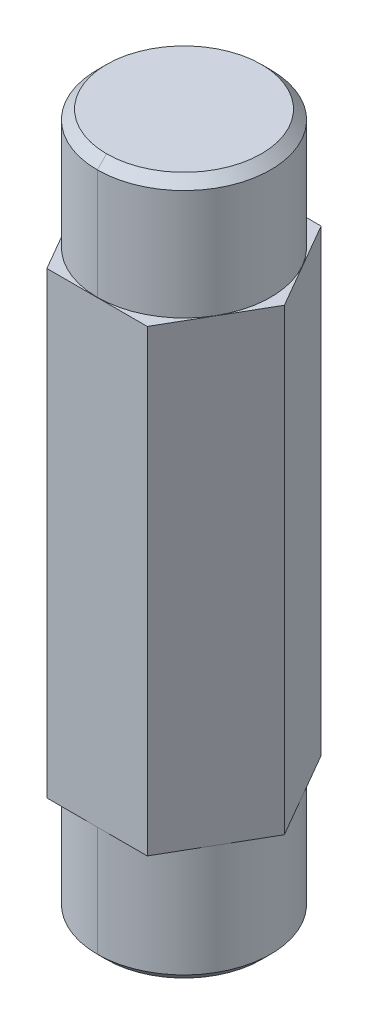
ISO-10303-21;
HEADER;
FILE_DESCRIPTION(('STEP AP214'),'2;1');
FILE_NAME('part.step','',(''),(''),'','','');
FILE_SCHEMA(('AUTOMOTIVE_DESIGN { 1 0 10303 214 1 1 1 1 }'));
ENDSEC;
DATA;
#1=APPLICATION_CONTEXT('core data for automotive mechanical design processes');
#2=APPLICATION_PROTOCOL_DEFINITION('international standard','automotive_design',2000,#1);
#3=PRODUCT_CONTEXT('',#1,'mechanical');
#4=PRODUCT('Part','Part','',(#3));
#5=PRODUCT_RELATED_PRODUCT_CATEGORY('part','',(#4));
#6=PRODUCT_DEFINITION_FORMATION('','',#4);
#7=PRODUCT_DEFINITION_CONTEXT('part definition',#1,'design');
#8=PRODUCT_DEFINITION('design','',#6,#7);
#9=PRODUCT_DEFINITION_SHAPE('','',#8);
#10=(LENGTH_UNIT() NAMED_UNIT(*) SI_UNIT(.MILLI.,.METRE.));
#11=(NAMED_UNIT(*) PLANE_ANGLE_UNIT() SI_UNIT($,.RADIAN.));
#12=(NAMED_UNIT(*) SI_UNIT($,.STERADIAN.) SOLID_ANGLE_UNIT());
#13=UNCERTAINTY_MEASURE_WITH_UNIT(LENGTH_MEASURE(1.E-05),#10,'distance_accuracy_value','');
#14=(GEOMETRIC_REPRESENTATION_CONTEXT(3) GLOBAL_UNCERTAINTY_ASSIGNED_CONTEXT((#13)) GLOBAL_UNIT_ASSIGNED_CONTEXT((#10,
#11,#12)) REPRESENTATION_CONTEXT('',''));
#15=CARTESIAN_POINT('',(0.,0.,0.));
#16=DIRECTION('',(0.,0.,1.));
#17=DIRECTION('',(1.,0.,0.));
#18=AXIS2_PLACEMENT_3D('',#15,#16,#17);
#19=CARTESIAN_POINT('',(-39.2241243202131,6.35,-16.6661167863654));
#20=DIRECTION('',(0.,-1.,0.));
#21=DIRECTION('',(0.,0.,-1.));
#22=AXIS2_PLACEMENT_3D('',#19,#20,#21);
#23=CYLINDRICAL_SURFACE('',#22,4.7498);
#24=DIRECTION('',(0.,-1.,0.));
#25=VECTOR('',#24,1.);
#26=CARTESIAN_POINT('',(-39.2241243202131,6.35,-11.9163167863655));
#27=LINE('',#26,#25);
#28=CARTESIAN_POINT('',(-39.2241243202131,5.842,-11.9163167863655));
#29=VERTEX_POINT('',#28);
#30=CARTESIAN_POINT('',(-39.2241243202131,-0.2032,-11.9163167863655));
#31=VERTEX_POINT('',#30);
#32=EDGE_CURVE('E296',#29,#31,#27,.T.);
#33=ORIENTED_EDGE('',*,*,#32,.F.);
#34=CARTESIAN_POINT('',(-39.2241243202131,5.842,-16.6661167863654));
#35=DIRECTION('',(0.,-1.,0.));
#36=DIRECTION('',(0.,0.,-1.));
#37=AXIS2_PLACEMENT_3D('',#34,#35,#36);
#38=CIRCLE('',#37,4.7498);
#39=CARTESIAN_POINT('',(-39.2241243202131,5.842,-21.4159167863655));
#40=VERTEX_POINT('',#39);
#41=EDGE_CURVE('E11',#29,#40,#38,.T.);
#42=ORIENTED_EDGE('',*,*,#41,.T.);
#43=DIRECTION('',(0.,-1.,0.));
#44=VECTOR('',#43,1.);
#45=CARTESIAN_POINT('',(-39.2241243202131,6.35,-21.4159167863655));
#46=LINE('',#45,#44);
#47=CARTESIAN_POINT('',(-39.2241243202131,-0.2032,-21.4159167863655));
#48=VERTEX_POINT('',#47);
#49=EDGE_CURVE('E191',#40,#48,#46,.T.);
#50=ORIENTED_EDGE('',*,*,#49,.T.);
#51=CARTESIAN_POINT('',(-39.2241243202131,-0.2032,-16.6661167863654));
#52=DIRECTION('',(0.,1.,0.));
#53=DIRECTION('',(0.,0.,1.));
#54=AXIS2_PLACEMENT_3D('',#51,#52,#53);
#55=CIRCLE('',#54,4.7498);
#56=EDGE_CURVE('E150',#48,#31,#55,.T.);
#57=ORIENTED_EDGE('',*,*,#56,.T.);
#58=EDGE_LOOP('',(#33,#42,#50,#57));
#59=FACE_BOUND('',#58,.T.);
#60=ADVANCED_FACE('F16',(#59),#23,.T.);
#61=CARTESIAN_POINT('',(-39.2241243202131,5.842,-16.6661167863654));
#62=DIRECTION('',(0.,-1.,0.));
#63=DIRECTION('',(0.,0.,-1.));
#64=AXIS2_PLACEMENT_3D('',#61,#62,#63);
#65=CONICAL_SURFACE('',#64,4.7498,0.785398163397452);
#66=DIRECTION('',(0.,-0.707106781186545,0.70710678118655));
#67=VECTOR('',#66,1.);
#68=CARTESIAN_POINT('',(-39.2241243202131,5.842,-11.9163167863655));
#69=LINE('',#68,#67);
#70=CARTESIAN_POINT('',(-39.2241243202131,6.35,-12.4243167863655));
#71=VERTEX_POINT('',#70);
#72=EDGE_CURVE('E182',#71,#29,#69,.T.);
#73=ORIENTED_EDGE('',*,*,#72,.F.);
#74=CARTESIAN_POINT('',(-39.2241243202131,6.35,-16.6661167863654));
#75=DIRECTION('',(0.,1.,0.));
#76=DIRECTION('',(0.,0.,-1.));
#77=AXIS2_PLACEMENT_3D('',#74,#75,#76);
#78=CIRCLE('',#77,4.2418);
#79=CARTESIAN_POINT('',(-39.2241243202131,6.35,-20.9079167863655));
#80=VERTEX_POINT('',#79);
#81=EDGE_CURVE('E24',#80,#71,#78,.T.);
#82=ORIENTED_EDGE('',*,*,#81,.F.);
#83=DIRECTION('',(0.,-0.707106781186545,-0.70710678118655));
#84=VECTOR('',#83,1.);
#85=CARTESIAN_POINT('',(-39.2241243202131,5.842,-21.4159167863655));
#86=LINE('',#85,#84);
#87=EDGE_CURVE('E175',#80,#40,#86,.T.);
#88=ORIENTED_EDGE('',*,*,#87,.T.);
#89=ORIENTED_EDGE('',*,*,#41,.F.);
#90=EDGE_LOOP('',(#73,#82,#88,#89));
#91=FACE_BOUND('',#90,.T.);
#92=ADVANCED_FACE('F275',(#91),#65,.T.);
#93=CARTESIAN_POINT('',(-39.2241243202131,6.35,-16.6661167863654));
#94=DIRECTION('',(0.,-1.,0.));
#95=DIRECTION('',(0.,0.,-1.));
#96=AXIS2_PLACEMENT_3D('',#93,#94,#95);
#97=PLANE('',#96);
#98=ORIENTED_EDGE('',*,*,#81,.T.);
#99=CARTESIAN_POINT('',(-39.2241243202131,6.35,-16.6661167863654));
#100=DIRECTION('',(0.,1.,0.));
#101=DIRECTION('',(0.,0.,-1.));
#102=AXIS2_PLACEMENT_3D('',#99,#100,#101);
#103=CIRCLE('',#102,4.2418);
#104=EDGE_CURVE('E187',#71,#80,#103,.T.);
#105=ORIENTED_EDGE('',*,*,#104,.T.);
#106=EDGE_LOOP('',(#98,#105));
#107=FACE_BOUND('',#106,.T.);
#108=ADVANCED_FACE('F271',(#107),#97,.F.);
#109=CARTESIAN_POINT('',(-44.7233856342443,-0.2032,-16.6661167863654));
#110=DIRECTION('',(0.,1.,0.));
#111=DIRECTION('',(1.,0.,0.));
#112=AXIS2_PLACEMENT_3D('',#109,#110,#111);
#113=PLANE('',#112);
#114=ORIENTED_EDGE('',*,*,#56,.F.);
#115=CARTESIAN_POINT('',(-39.2241243202131,-0.2032,-16.6661167863654));
#116=DIRECTION('',(0.,1.,0.));
#117=DIRECTION('',(0.,0.,1.));
#118=AXIS2_PLACEMENT_3D('',#115,#116,#117);
#119=CIRCLE('',#118,4.7498);
#120=EDGE_CURVE('E289',#31,#48,#119,.T.);
#121=ORIENTED_EDGE('',*,*,#120,.F.);
#122=EDGE_LOOP('',(#114,#121));
#123=FACE_BOUND('',#122,.T.);
#124=DIRECTION('',(-0.5,0.,0.866025403784438));
#125=VECTOR('',#124,1.);
#126=CARTESIAN_POINT('',(-41.9737549772286,-0.2032,-21.4286167863654));
#127=LINE('',#126,#125);
#128=CARTESIAN_POINT('',(-41.9737549772286,-0.2032,-21.4286167863654));
#129=VERTEX_POINT('',#128);
#130=CARTESIAN_POINT('',(-44.7233856342443,-0.2032,-16.6661167863654));
#131=VERTEX_POINT('',#130);
#132=EDGE_CURVE('E37',#129,#131,#127,.T.);
#133=ORIENTED_EDGE('',*,*,#132,.T.);
#134=DIRECTION('',(0.5,0.,0.866025403784439));
#135=VECTOR('',#134,1.);
#136=CARTESIAN_POINT('',(-44.7233856342443,-0.2032,-16.6661167863654));
#137=LINE('',#136,#135);
#138=CARTESIAN_POINT('',(-41.9737549772286,-0.2032,-11.9036167863655));
#139=VERTEX_POINT('',#138);
#140=EDGE_CURVE('E215',#131,#139,#137,.T.);
#141=ORIENTED_EDGE('',*,*,#140,.T.);
#142=DIRECTION('',(1.,0.,0.));
#143=VECTOR('',#142,1.);
#144=CARTESIAN_POINT('',(-41.9737549772286,-0.2032,-11.9036167863655));
#145=LINE('',#144,#143);
#146=CARTESIAN_POINT('',(-36.4744936631975,-0.2032,-11.9036167863655));
#147=VERTEX_POINT('',#146);
#148=EDGE_CURVE('E226',#139,#147,#145,.T.);
#149=ORIENTED_EDGE('',*,*,#148,.T.);
#150=DIRECTION('',(0.5,0.,-0.866025403784438));
#151=VECTOR('',#150,1.);
#152=CARTESIAN_POINT('',(-36.4744936631975,-0.2032,-11.9036167863655));
#153=LINE('',#152,#151);
#154=CARTESIAN_POINT('',(-33.7248630061819,-0.2032,-16.6661167863654));
#155=VERTEX_POINT('',#154);
#156=EDGE_CURVE('E241',#147,#155,#153,.T.);
#157=ORIENTED_EDGE('',*,*,#156,.T.);
#158=DIRECTION('',(-0.5,0.,-0.866025403784439));
#159=VECTOR('',#158,1.);
#160=CARTESIAN_POINT('',(-33.7248630061819,-0.2032,-16.6661167863654));
#161=LINE('',#160,#159);
#162=CARTESIAN_POINT('',(-36.4744936631975,-0.2032,-21.4286167863654));
#163=VERTEX_POINT('',#162);
#164=EDGE_CURVE('E208',#155,#163,#161,.T.);
#165=ORIENTED_EDGE('',*,*,#164,.T.);
#166=DIRECTION('',(-1.,0.,0.));
#167=VECTOR('',#166,1.);
#168=CARTESIAN_POINT('',(-36.4744936631975,-0.2032,-21.4286167863654));
#169=LINE('',#168,#167);
#170=EDGE_CURVE('E253',#163,#129,#169,.T.);
#171=ORIENTED_EDGE('',*,*,#170,.T.);
#172=EDGE_LOOP('',(#133,#141,#149,#157,#165,#171));
#173=FACE_BOUND('',#172,.T.);
#174=ADVANCED_FACE('F568',(#123,#173),#113,.T.);
#175=CARTESIAN_POINT('',(-39.2241243202131,-31.877,-16.6661167863654));
#176=DIRECTION('',(0.,1.,0.));
#177=DIRECTION('',(0.,0.,1.));
#178=AXIS2_PLACEMENT_3D('',#175,#176,#177);
#179=CYLINDRICAL_SURFACE('',#178,4.7498);
#180=DIRECTION('',(0.,1.,0.));
#181=VECTOR('',#180,1.);
#182=CARTESIAN_POINT('',(-39.2241243202131,-31.877,-21.4159167863655));
#183=LINE('',#182,#181);
#184=CARTESIAN_POINT('',(-39.2241243202131,-31.369,-21.4159167863655));
#185=VERTEX_POINT('',#184);
#186=CARTESIAN_POINT('',(-39.2241243202131,-25.3238,-21.4159167863655));
#187=VERTEX_POINT('',#186);
#188=EDGE_CURVE('E163',#185,#187,#183,.T.);
#189=ORIENTED_EDGE('',*,*,#188,.F.);
#190=CARTESIAN_POINT('',(-39.2241243202131,-31.369,-16.6661167863654));
#191=DIRECTION('',(0.,1.,0.));
#192=DIRECTION('',(0.,0.,1.));
#193=AXIS2_PLACEMENT_3D('',#190,#191,#192);
#194=CIRCLE('',#193,4.7498);
#195=CARTESIAN_POINT('',(-39.2241243202131,-31.369,-11.9163167863655));
#196=VERTEX_POINT('',#195);
#197=EDGE_CURVE('E138',#185,#196,#194,.T.);
#198=ORIENTED_EDGE('',*,*,#197,.T.);
#199=DIRECTION('',(0.,1.,0.));
#200=VECTOR('',#199,1.);
#201=CARTESIAN_POINT('',(-39.2241243202131,-31.877,-11.9163167863655));
#202=LINE('',#201,#200);
#203=CARTESIAN_POINT('',(-39.2241243202131,-25.3238,-11.9163167863655));
#204=VERTEX_POINT('',#203);
#205=EDGE_CURVE('E173',#196,#204,#202,.T.);
#206=ORIENTED_EDGE('',*,*,#205,.T.);
#207=CARTESIAN_POINT('',(-39.2241243202131,-25.3238,-16.6661167863654));
#208=DIRECTION('',(0.,-1.,0.));
#209=DIRECTION('',(0.,0.,-1.));
#210=AXIS2_PLACEMENT_3D('',#207,#208,#209);
#211=CIRCLE('',#210,4.7498);
#212=EDGE_CURVE('E165',#204,#187,#211,.T.);
#213=ORIENTED_EDGE('',*,*,#212,.T.);
#214=EDGE_LOOP('',(#189,#198,#206,#213));
#215=FACE_BOUND('',#214,.T.);
#216=ADVANCED_FACE('F164',(#215),#179,.T.);
#217=CARTESIAN_POINT('',(-39.2241243202131,-31.369,-16.6661167863654));
#218=DIRECTION('',(0.,1.,0.));
#219=DIRECTION('',(0.,0.,1.));
#220=AXIS2_PLACEMENT_3D('',#217,#218,#219);
#221=CONICAL_SURFACE('',#220,4.7498,0.78539816339745);
#222=DIRECTION('',(0.,0.707106781186546,-0.707106781186549));
#223=VECTOR('',#222,1.);
#224=CARTESIAN_POINT('',(-39.2241243202131,-31.369,-21.4159167863655));
#225=LINE('',#224,#223);
#226=CARTESIAN_POINT('',(-39.2241243202131,-31.877,-20.9079167863655));
#227=VERTEX_POINT('',#226);
#228=EDGE_CURVE('E141',#227,#185,#225,.T.);
#229=ORIENTED_EDGE('',*,*,#228,.F.);
#230=CARTESIAN_POINT('',(-39.2241243202131,-31.877,-16.6661167863654));
#231=DIRECTION('',(0.,-1.,0.));
#232=DIRECTION('',(0.,0.,1.));
#233=AXIS2_PLACEMENT_3D('',#230,#231,#232);
#234=CIRCLE('',#233,4.2418);
#235=CARTESIAN_POINT('',(-39.2241243202131,-31.877,-12.4243167863655));
#236=VERTEX_POINT('',#235);
#237=EDGE_CURVE('E151',#236,#227,#234,.T.);
#238=ORIENTED_EDGE('',*,*,#237,.F.);
#239=DIRECTION('',(0.,0.707106781186546,0.707106781186549));
#240=VECTOR('',#239,1.);
#241=CARTESIAN_POINT('',(-39.2241243202131,-31.369,-11.9163167863655));
#242=LINE('',#241,#240);
#243=EDGE_CURVE('E144',#236,#196,#242,.T.);
#244=ORIENTED_EDGE('',*,*,#243,.T.);
#245=ORIENTED_EDGE('',*,*,#197,.F.);
#246=EDGE_LOOP('',(#229,#238,#244,#245));
#247=FACE_BOUND('',#246,.T.);
#248=ADVANCED_FACE('F140',(#247),#221,.T.);
#249=CARTESIAN_POINT('',(-39.2241243202131,-31.877,-16.6661167863654));
#250=DIRECTION('',(0.,1.,0.));
#251=DIRECTION('',(1.,0.,0.));
#252=AXIS2_PLACEMENT_3D('',#249,#250,#251);
#253=PLANE('',#252);
#254=ORIENTED_EDGE('',*,*,#237,.T.);
#255=CARTESIAN_POINT('',(-39.2241243202131,-31.877,-16.6661167863654));
#256=DIRECTION('',(0.,-1.,0.));
#257=DIRECTION('',(0.,0.,1.));
#258=AXIS2_PLACEMENT_3D('',#255,#256,#257);
#259=CIRCLE('',#258,4.2418);
#260=EDGE_CURVE('E159',#227,#236,#259,.T.);
#261=ORIENTED_EDGE('',*,*,#260,.T.);
#262=EDGE_LOOP('',(#254,#261));
#263=FACE_BOUND('',#262,.T.);
#264=ADVANCED_FACE('F607',(#263),#253,.F.);
#265=CARTESIAN_POINT('',(-41.9737549772286,-25.3238,-11.9036167863655));
#266=DIRECTION('',(0.,-1.,0.));
#267=DIRECTION('',(0.,0.,-1.));
#268=AXIS2_PLACEMENT_3D('',#265,#266,#267);
#269=PLANE('',#268);
#270=ORIENTED_EDGE('',*,*,#212,.F.);
#271=CARTESIAN_POINT('',(-39.2241243202131,-25.3238,-16.6661167863654));
#272=DIRECTION('',(0.,-1.,0.));
#273=DIRECTION('',(0.,0.,-1.));
#274=AXIS2_PLACEMENT_3D('',#271,#272,#273);
#275=CIRCLE('',#274,4.7498);
#276=EDGE_CURVE('E170',#187,#204,#275,.T.);
#277=ORIENTED_EDGE('',*,*,#276,.F.);
#278=EDGE_LOOP('',(#270,#277));
#279=FACE_BOUND('',#278,.T.);
#280=DIRECTION('',(-1.,0.,0.));
#281=VECTOR('',#280,1.);
#282=CARTESIAN_POINT('',(-36.4744936631975,-25.3238,-11.9036167863655));
#283=LINE('',#282,#281);
#284=CARTESIAN_POINT('',(-36.4744936631975,-25.3238,-11.9036167863655));
#285=VERTEX_POINT('',#284);
#286=CARTESIAN_POINT('',(-41.9737549772286,-25.3238,-11.9036167863655));
#287=VERTEX_POINT('',#286);
#288=EDGE_CURVE('E234',#285,#287,#283,.T.);
#289=ORIENTED_EDGE('',*,*,#288,.T.);
#290=DIRECTION('',(-0.5,0.,-0.866025403784439));
#291=VECTOR('',#290,1.);
#292=CARTESIAN_POINT('',(-41.9737549772286,-25.3238,-11.9036167863655));
#293=LINE('',#292,#291);
#294=CARTESIAN_POINT('',(-44.7233856342443,-25.3238,-16.6661167863654));
#295=VERTEX_POINT('',#294);
#296=EDGE_CURVE('E219',#287,#295,#293,.T.);
#297=ORIENTED_EDGE('',*,*,#296,.T.);
#298=DIRECTION('',(0.5,0.,-0.866025403784438));
#299=VECTOR('',#298,1.);
#300=CARTESIAN_POINT('',(-44.7233856342443,-25.3238,-16.6661167863654));
#301=LINE('',#300,#299);
#302=CARTESIAN_POINT('',(-41.9737549772286,-25.3238,-21.4286167863654));
#303=VERTEX_POINT('',#302);
#304=EDGE_CURVE('E48',#295,#303,#301,.T.);
#305=ORIENTED_EDGE('',*,*,#304,.T.);
#306=DIRECTION('',(1.,0.,0.));
#307=VECTOR('',#306,1.);
#308=CARTESIAN_POINT('',(-41.9737549772286,-25.3238,-21.4286167863654));
#309=LINE('',#308,#307);
#310=CARTESIAN_POINT('',(-36.4744936631975,-25.3238,-21.4286167863654));
#311=VERTEX_POINT('',#310);
#312=EDGE_CURVE('E256',#303,#311,#309,.T.);
#313=ORIENTED_EDGE('',*,*,#312,.T.);
#314=DIRECTION('',(0.5,0.,0.866025403784439));
#315=VECTOR('',#314,1.);
#316=CARTESIAN_POINT('',(-36.4744936631975,-25.3238,-21.4286167863654));
#317=LINE('',#316,#315);
#318=CARTESIAN_POINT('',(-33.7248630061819,-25.3238,-16.6661167863654));
#319=VERTEX_POINT('',#318);
#320=EDGE_CURVE('E230',#311,#319,#317,.T.);
#321=ORIENTED_EDGE('',*,*,#320,.T.);
#322=DIRECTION('',(-0.5,0.,0.866025403784438));
#323=VECTOR('',#322,1.);
#324=CARTESIAN_POINT('',(-33.7248630061819,-25.3238,-16.6661167863654));
#325=LINE('',#324,#323);
#326=EDGE_CURVE('E209',#319,#285,#325,.T.);
#327=ORIENTED_EDGE('',*,*,#326,.T.);
#328=EDGE_LOOP('',(#289,#297,#305,#313,#321,#327));
#329=FACE_BOUND('',#328,.T.);
#330=ADVANCED_FACE('F597',(#279,#329),#269,.T.);
#331=CARTESIAN_POINT('',(-41.9737549772286,-25.527,-21.4286167863654));
#332=DIRECTION('',(-0.866025403784438,0.,-0.5));
#333=DIRECTION('',(-0.5,0.,0.866025403784438));
#334=AXIS2_PLACEMENT_3D('',#331,#332,#333);
#335=PLANE('',#334);
#336=DIRECTION('',(0.,1.,0.));
#337=VECTOR('',#336,1.);
#338=CARTESIAN_POINT('',(-44.7233856342443,-25.527,-16.6661167863654));
#339=LINE('',#338,#337);
#340=EDGE_CURVE('E186',#295,#131,#339,.T.);
#341=ORIENTED_EDGE('',*,*,#340,.T.);
#342=ORIENTED_EDGE('',*,*,#132,.F.);
#343=DIRECTION('',(0.,1.,0.));
#344=VECTOR('',#343,1.);
#345=CARTESIAN_POINT('',(-41.9737549772286,-25.527,-21.4286167863654));
#346=LINE('',#345,#344);
#347=EDGE_CURVE('E249',#303,#129,#346,.T.);
#348=ORIENTED_EDGE('',*,*,#347,.F.);
#349=ORIENTED_EDGE('',*,*,#304,.F.);
#350=EDGE_LOOP('',(#341,#342,#348,#349));
#351=FACE_BOUND('',#350,.T.);
#352=ADVANCED_FACE('F555',(#351),#335,.T.);
#353=CARTESIAN_POINT('',(-36.4744936631975,-25.527,-21.4286167863654));
#354=DIRECTION('',(0.,0.,-1.));
#355=DIRECTION('',(0.,-1.,0.));
#356=AXIS2_PLACEMENT_3D('',#353,#354,#355);
#357=PLANE('',#356);
#358=ORIENTED_EDGE('',*,*,#347,.T.);
#359=ORIENTED_EDGE('',*,*,#170,.F.);
#360=DIRECTION('',(0.,1.,0.));
#361=VECTOR('',#360,1.);
#362=CARTESIAN_POINT('',(-36.4744936631975,-25.527,-21.4286167863654));
#363=LINE('',#362,#361);
#364=EDGE_CURVE('E204',#311,#163,#363,.T.);
#365=ORIENTED_EDGE('',*,*,#364,.F.);
#366=ORIENTED_EDGE('',*,*,#312,.F.);
#367=EDGE_LOOP('',(#358,#359,#365,#366));
#368=FACE_BOUND('',#367,.T.);
#369=ADVANCED_FACE('F549',(#368),#357,.T.);
#370=CARTESIAN_POINT('',(-33.7248630061819,-25.527,-16.6661167863654));
#371=DIRECTION('',(0.866025403784439,0.,-0.5));
#372=DIRECTION('',(0.,-1.,0.));
#373=AXIS2_PLACEMENT_3D('',#370,#371,#372);
#374=PLANE('',#373);
#375=ORIENTED_EDGE('',*,*,#364,.T.);
#376=ORIENTED_EDGE('',*,*,#164,.F.);
#377=DIRECTION('',(0.,1.,0.));
#378=VECTOR('',#377,1.);
#379=CARTESIAN_POINT('',(-33.7248630061819,-25.527,-16.6661167863654));
#380=LINE('',#379,#378);
#381=EDGE_CURVE('E237',#319,#155,#380,.T.);
#382=ORIENTED_EDGE('',*,*,#381,.F.);
#383=ORIENTED_EDGE('',*,*,#320,.F.);
#384=EDGE_LOOP('',(#375,#376,#382,#383));
#385=FACE_BOUND('',#384,.T.);
#386=ADVANCED_FACE('F554',(#385),#374,.T.);
#387=CARTESIAN_POINT('',(-36.4744936631975,-25.527,-11.9036167863655));
#388=DIRECTION('',(0.866025403784438,0.,0.5));
#389=DIRECTION('',(0.,-1.,0.));
#390=AXIS2_PLACEMENT_3D('',#387,#388,#389);
#391=PLANE('',#390);
#392=ORIENTED_EDGE('',*,*,#381,.T.);
#393=ORIENTED_EDGE('',*,*,#156,.F.);
#394=DIRECTION('',(0.,1.,0.));
#395=VECTOR('',#394,1.);
#396=CARTESIAN_POINT('',(-36.4744936631975,-25.527,-11.9036167863655));
#397=LINE('',#396,#395);
#398=EDGE_CURVE('E222',#285,#147,#397,.T.);
#399=ORIENTED_EDGE('',*,*,#398,.F.);
#400=ORIENTED_EDGE('',*,*,#326,.F.);
#401=EDGE_LOOP('',(#392,#393,#399,#400));
#402=FACE_BOUND('',#401,.T.);
#403=ADVANCED_FACE('F541',(#402),#391,.T.);
#404=CARTESIAN_POINT('',(-41.9737549772286,-25.527,-11.9036167863655));
#405=DIRECTION('',(0.,0.,1.));
#406=DIRECTION('',(1.,0.,0.));
#407=AXIS2_PLACEMENT_3D('',#404,#405,#406);
#408=PLANE('',#407);
#409=ORIENTED_EDGE('',*,*,#398,.T.);
#410=ORIENTED_EDGE('',*,*,#148,.F.);
#411=DIRECTION('',(0.,1.,0.));
#412=VECTOR('',#411,1.);
#413=CARTESIAN_POINT('',(-41.9737549772286,-25.527,-11.9036167863655));
#414=LINE('',#413,#412);
#415=EDGE_CURVE('E203',#287,#139,#414,.T.);
#416=ORIENTED_EDGE('',*,*,#415,.F.);
#417=ORIENTED_EDGE('',*,*,#288,.F.);
#418=EDGE_LOOP('',(#409,#410,#416,#417));
#419=FACE_BOUND('',#418,.T.);
#420=ADVANCED_FACE('F530',(#419),#408,.T.);
#421=CARTESIAN_POINT('',(-44.7233856342443,-25.527,-16.6661167863654));
#422=DIRECTION('',(-0.866025403784439,0.,0.5));
#423=DIRECTION('',(0.,1.,0.));
#424=AXIS2_PLACEMENT_3D('',#421,#422,#423);
#425=PLANE('',#424);
#426=ORIENTED_EDGE('',*,*,#415,.T.);
#427=ORIENTED_EDGE('',*,*,#140,.F.);
#428=ORIENTED_EDGE('',*,*,#340,.F.);
#429=ORIENTED_EDGE('',*,*,#296,.F.);
#430=EDGE_LOOP('',(#426,#427,#428,#429));
#431=FACE_BOUND('',#430,.T.);
#432=ADVANCED_FACE('F520',(#431),#425,.T.);
#433=CARTESIAN_POINT('',(-39.2241243202131,-31.369,-16.6661167863654));
#434=DIRECTION('',(0.,1.,0.));
#435=DIRECTION('',(0.,0.,1.));
#436=AXIS2_PLACEMENT_3D('',#433,#434,#435);
#437=CONICAL_SURFACE('',#436,4.7498,0.78539816339745);
#438=ORIENTED_EDGE('',*,*,#260,.F.);
#439=ORIENTED_EDGE('',*,*,#228,.T.);
#440=CARTESIAN_POINT('',(-39.2241243202131,-31.369,-16.6661167863654));
#441=DIRECTION('',(0.,1.,0.));
#442=DIRECTION('',(0.,0.,1.));
#443=AXIS2_PLACEMENT_3D('',#440,#441,#442);
#444=CIRCLE('',#443,4.7498);
#445=EDGE_CURVE('E157',#196,#185,#444,.T.);
#446=ORIENTED_EDGE('',*,*,#445,.F.);
#447=ORIENTED_EDGE('',*,*,#243,.F.);
#448=EDGE_LOOP('',(#438,#439,#446,#447));
#449=FACE_BOUND('',#448,.T.);
#450=ADVANCED_FACE('F155',(#449),#437,.T.);
#451=CARTESIAN_POINT('',(-39.2241243202131,-31.877,-16.6661167863654));
#452=DIRECTION('',(0.,1.,0.));
#453=DIRECTION('',(0.,0.,1.));
#454=AXIS2_PLACEMENT_3D('',#451,#452,#453);
#455=CYLINDRICAL_SURFACE('',#454,4.7498);
#456=ORIENTED_EDGE('',*,*,#445,.T.);
#457=ORIENTED_EDGE('',*,*,#188,.T.);
#458=ORIENTED_EDGE('',*,*,#276,.T.);
#459=ORIENTED_EDGE('',*,*,#205,.F.);
#460=EDGE_LOOP('',(#456,#457,#458,#459));
#461=FACE_BOUND('',#460,.T.);
#462=ADVANCED_FACE('F172',(#461),#455,.T.);
#463=CARTESIAN_POINT('',(-39.2241243202131,5.842,-16.6661167863654));
#464=DIRECTION('',(0.,-1.,0.));
#465=DIRECTION('',(0.,0.,-1.));
#466=AXIS2_PLACEMENT_3D('',#463,#464,#465);
#467=CONICAL_SURFACE('',#466,4.7498,0.785398163397452);
#468=ORIENTED_EDGE('',*,*,#104,.F.);
#469=ORIENTED_EDGE('',*,*,#72,.T.);
#470=CARTESIAN_POINT('',(-39.2241243202131,5.842,-16.6661167863654));
#471=DIRECTION('',(0.,-1.,0.));
#472=DIRECTION('',(0.,0.,-1.));
#473=AXIS2_PLACEMENT_3D('',#470,#471,#472);
#474=CIRCLE('',#473,4.7498);
#475=EDGE_CURVE('E281',#40,#29,#474,.T.);
#476=ORIENTED_EDGE('',*,*,#475,.F.);
#477=ORIENTED_EDGE('',*,*,#87,.F.);
#478=EDGE_LOOP('',(#468,#469,#476,#477));
#479=FACE_BOUND('',#478,.T.);
#480=ADVANCED_FACE('F279',(#479),#467,.T.);
#481=CARTESIAN_POINT('',(-39.2241243202131,6.35,-16.6661167863654));
#482=DIRECTION('',(0.,-1.,0.));
#483=DIRECTION('',(0.,0.,-1.));
#484=AXIS2_PLACEMENT_3D('',#481,#482,#483);
#485=CYLINDRICAL_SURFACE('',#484,4.7498);
#486=ORIENTED_EDGE('',*,*,#475,.T.);
#487=ORIENTED_EDGE('',*,*,#32,.T.);
#488=ORIENTED_EDGE('',*,*,#120,.T.);
#489=ORIENTED_EDGE('',*,*,#49,.F.);
#490=EDGE_LOOP('',(#486,#487,#488,#489));
#491=FACE_BOUND('',#490,.T.);
#492=ADVANCED_FACE('F286',(#491),#485,.T.);
#493=CLOSED_SHELL('',(#60,#92,#108,#174,#216,#248,#264,#330,#352,#369,#386,#403,#420,#432,#450,
#462,#480,#492));
#494=MANIFOLD_SOLID_BREP('B1',#493);
#495=ADVANCED_BREP_SHAPE_REPRESENTATION('',(#18,#494),#14);
#496=SHAPE_DEFINITION_REPRESENTATION(#9,#495);
ENDSEC;
END-ISO-10303-21;
